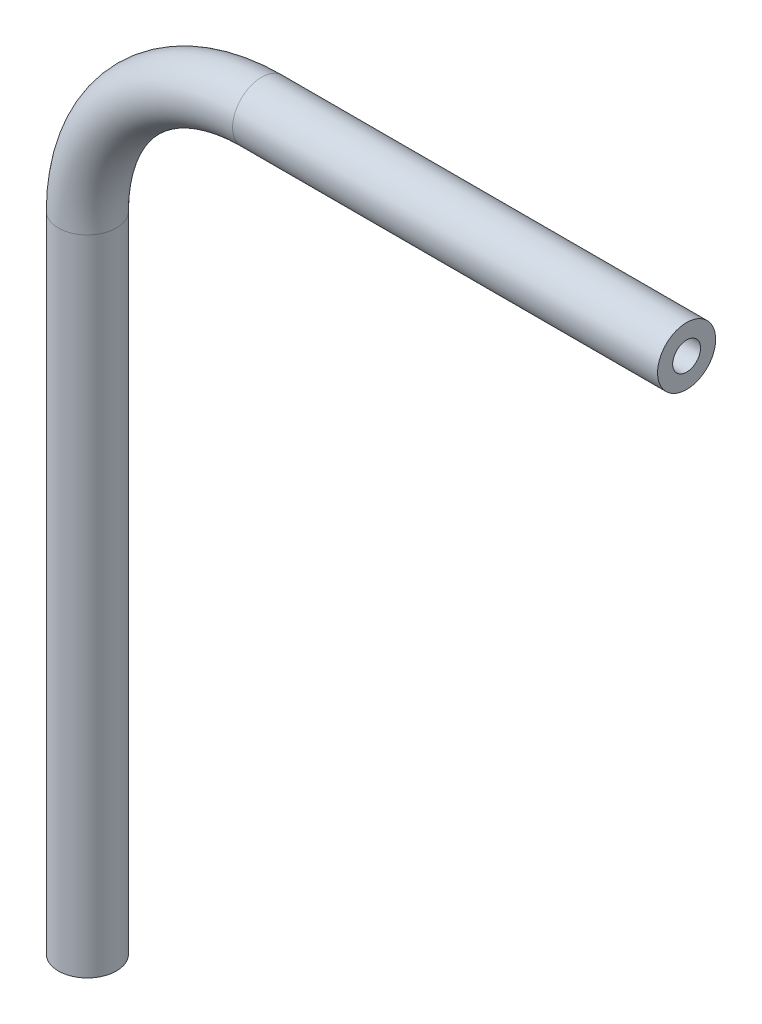
ISO-10303-21;
HEADER;
FILE_DESCRIPTION(('STEP AP214'),'2;1');
FILE_NAME('part.step','',(''),(''),'','','');
FILE_SCHEMA(('AUTOMOTIVE_DESIGN { 1 0 10303 214 1 1 1 1 }'));
ENDSEC;
DATA;
#1=APPLICATION_CONTEXT('core data for automotive mechanical design processes');
#2=APPLICATION_PROTOCOL_DEFINITION('international standard','automotive_design',2000,#1);
#3=PRODUCT_CONTEXT('',#1,'mechanical');
#4=PRODUCT('Part','Part','',(#3));
#5=PRODUCT_RELATED_PRODUCT_CATEGORY('part','',(#4));
#6=PRODUCT_DEFINITION_FORMATION('','',#4);
#7=PRODUCT_DEFINITION_CONTEXT('part definition',#1,'design');
#8=PRODUCT_DEFINITION('design','',#6,#7);
#9=PRODUCT_DEFINITION_SHAPE('','',#8);
#10=(LENGTH_UNIT() NAMED_UNIT(*) SI_UNIT(.MILLI.,.METRE.));
#11=(NAMED_UNIT(*) PLANE_ANGLE_UNIT() SI_UNIT($,.RADIAN.));
#12=(NAMED_UNIT(*) SI_UNIT($,.STERADIAN.) SOLID_ANGLE_UNIT());
#13=UNCERTAINTY_MEASURE_WITH_UNIT(LENGTH_MEASURE(1.E-05),#10,'distance_accuracy_value','');
#14=(GEOMETRIC_REPRESENTATION_CONTEXT(3) GLOBAL_UNCERTAINTY_ASSIGNED_CONTEXT((#13)) GLOBAL_UNIT_ASSIGNED_CONTEXT((#10,
#11,#12)) REPRESENTATION_CONTEXT('',''));
#15=CARTESIAN_POINT('',(0.,0.,0.));
#16=DIRECTION('',(0.,0.,1.));
#17=DIRECTION('',(1.,0.,0.));
#18=AXIS2_PLACEMENT_3D('',#15,#16,#17);
#19=CARTESIAN_POINT('',(0.,-71.8803178807946,0.));
#20=DIRECTION('',(0.,1.,0.));
#21=DIRECTION('',(-1.,0.,0.));
#22=AXIS2_PLACEMENT_3D('',#19,#20,#21);
#23=CYLINDRICAL_SURFACE('',#22,3.175);
#24=CARTESIAN_POINT('',(0.,-1.52231788079483,0.));
#25=DIRECTION('',(0.,1.,0.));
#26=DIRECTION('',(-1.,0.,0.));
#27=AXIS2_PLACEMENT_3D('',#24,#25,#26);
#28=CIRCLE('',#27,3.175);
#29=CARTESIAN_POINT('',(-3.175,-1.52231788079486,0.));
#30=VERTEX_POINT('',#29);
#31=EDGE_CURVE('E84',#30,#30,#28,.T.);
#32=ORIENTED_EDGE('',*,*,#31,.F.);
#33=EDGE_LOOP('',(#32));
#34=FACE_BOUND('',#33,.T.);
#35=CARTESIAN_POINT('',(0.,-71.8803178807946,0.));
#36=DIRECTION('',(0.,1.,0.));
#37=DIRECTION('',(-1.,0.,0.));
#38=AXIS2_PLACEMENT_3D('',#35,#36,#37);
#39=CIRCLE('',#38,3.175);
#40=CARTESIAN_POINT('',(-3.175,-71.8803178807946,0.));
#41=VERTEX_POINT('',#40);
#42=EDGE_CURVE('E53',#41,#41,#39,.T.);
#43=ORIENTED_EDGE('',*,*,#42,.T.);
#44=EDGE_LOOP('',(#43));
#45=FACE_BOUND('',#44,.T.);
#46=ADVANCED_FACE('F38',(#34,#45),#23,.T.);
#47=CARTESIAN_POINT('',(19.05,-1.52231788079469,0.));
#48=DIRECTION('',(0.,0.,-1.));
#49=DIRECTION('',(-1.,0.,0.));
#50=AXIS2_PLACEMENT_3D('',#47,#48,#49);
#51=TOROIDAL_SURFACE('',#50,19.05,3.175);
#52=CARTESIAN_POINT('',(19.0500000000001,17.5276821192053,0.));
#53=DIRECTION('',(1.,0.,0.));
#54=DIRECTION('',(0.,1.,0.));
#55=AXIS2_PLACEMENT_3D('',#52,#53,#54);
#56=CIRCLE('',#55,3.175);
#57=CARTESIAN_POINT('',(19.0500000000001,20.7026821192053,0.));
#58=VERTEX_POINT('',#57);
#59=EDGE_CURVE('E42',#58,#58,#56,.T.);
#60=CARTESIAN_POINT('',(19.05,-1.52231788079469,0.));
#61=DIRECTION('',(0.,0.,-1.));
#62=DIRECTION('',(-1.,0.,0.));
#63=AXIS2_PLACEMENT_3D('',#60,#61,#62);
#64=CIRCLE('',#63,22.225);
#65=EDGE_CURVE('',#30,#58,#64,.T.);
#66=ORIENTED_EDGE('',*,*,#31,.T.);
#67=ORIENTED_EDGE('',*,*,#59,.F.);
#68=ORIENTED_EDGE('',*,*,#65,.T.);
#69=ORIENTED_EDGE('',*,*,#65,.F.);
#70=EDGE_LOOP('',(#66,#68,#67,#69));
#71=FACE_BOUND('',#70,.T.);
#72=ADVANCED_FACE('F92',(#71),#51,.T.);
#73=CARTESIAN_POINT('',(19.0500000000001,17.5276821192053,0.));
#74=DIRECTION('',(1.,0.,0.));
#75=DIRECTION('',(0.,1.,0.));
#76=AXIS2_PLACEMENT_3D('',#73,#74,#75);
#77=CYLINDRICAL_SURFACE('',#76,3.175);
#78=CARTESIAN_POINT('',(65.517903,17.5276821192052,0.));
#79=DIRECTION('',(1.,0.,0.));
#80=DIRECTION('',(0.,1.,0.));
#81=AXIS2_PLACEMENT_3D('',#78,#79,#80);
#82=CIRCLE('',#81,3.175);
#83=CARTESIAN_POINT('',(65.517903,20.7026821192052,0.));
#84=VERTEX_POINT('',#83);
#85=EDGE_CURVE('E58',#84,#84,#82,.T.);
#86=ORIENTED_EDGE('',*,*,#85,.F.);
#87=EDGE_LOOP('',(#86));
#88=FACE_BOUND('',#87,.T.);
#89=ORIENTED_EDGE('',*,*,#59,.T.);
#90=EDGE_LOOP('',(#89));
#91=FACE_BOUND('',#90,.T.);
#92=ADVANCED_FACE('F40',(#88,#91),#77,.T.);
#93=CARTESIAN_POINT('',(0.,-71.8803178807946,0.));
#94=DIRECTION('',(0.,1.,0.));
#95=DIRECTION('',(-1.,0.,0.));
#96=AXIS2_PLACEMENT_3D('',#93,#94,#95);
#97=PLANE('',#96);
#98=CARTESIAN_POINT('',(0.,-71.8803178807946,0.));
#99=DIRECTION('',(0.,1.,0.));
#100=DIRECTION('',(-1.,0.,0.));
#101=AXIS2_PLACEMENT_3D('',#98,#99,#100);
#102=CIRCLE('',#101,1.524);
#103=CARTESIAN_POINT('',(-1.524,-71.8803178807946,0.));
#104=VERTEX_POINT('',#103);
#105=EDGE_CURVE('E79',#104,#104,#102,.F.);
#106=ORIENTED_EDGE('',*,*,#105,.F.);
#107=EDGE_LOOP('',(#106));
#108=FACE_BOUND('',#107,.T.);
#109=ORIENTED_EDGE('',*,*,#42,.F.);
#110=EDGE_LOOP('',(#109));
#111=FACE_BOUND('',#110,.T.);
#112=ADVANCED_FACE('F98',(#108,#111),#97,.F.);
#113=CARTESIAN_POINT('',(65.517903,17.5276821192052,0.));
#114=DIRECTION('',(1.,0.,0.));
#115=DIRECTION('',(0.,1.,0.));
#116=AXIS2_PLACEMENT_3D('',#113,#114,#115);
#117=PLANE('',#116);
#118=CARTESIAN_POINT('',(65.517903,17.5276821192052,0.));
#119=DIRECTION('',(1.,0.,0.));
#120=DIRECTION('',(0.,1.,0.));
#121=AXIS2_PLACEMENT_3D('',#118,#119,#120);
#122=CIRCLE('',#121,1.524);
#123=CARTESIAN_POINT('',(65.517903,19.0516821192052,0.));
#124=VERTEX_POINT('',#123);
#125=EDGE_CURVE('E11',#124,#124,#122,.F.);
#126=ORIENTED_EDGE('',*,*,#125,.T.);
#127=EDGE_LOOP('',(#126));
#128=FACE_BOUND('',#127,.T.);
#129=ORIENTED_EDGE('',*,*,#85,.T.);
#130=EDGE_LOOP('',(#129));
#131=FACE_BOUND('',#130,.T.);
#132=ADVANCED_FACE('F65',(#128,#131),#117,.T.);
#133=CARTESIAN_POINT('',(0.,-71.8803178807946,0.));
#134=DIRECTION('',(0.,1.,0.));
#135=DIRECTION('',(-1.,0.,0.));
#136=AXIS2_PLACEMENT_3D('',#133,#134,#135);
#137=CYLINDRICAL_SURFACE('',#136,1.524);
#138=CARTESIAN_POINT('',(0.,-1.52231788079483,0.));
#139=DIRECTION('',(0.,1.,0.));
#140=DIRECTION('',(-1.,0.,0.));
#141=AXIS2_PLACEMENT_3D('',#138,#139,#140);
#142=CIRCLE('',#141,1.524);
#143=CARTESIAN_POINT('',(-1.524,-1.52231788079485,0.));
#144=VERTEX_POINT('',#143);
#145=EDGE_CURVE('E76',#144,#144,#142,.F.);
#146=ORIENTED_EDGE('',*,*,#145,.F.);
#147=EDGE_LOOP('',(#146));
#148=FACE_BOUND('',#147,.T.);
#149=ORIENTED_EDGE('',*,*,#105,.T.);
#150=EDGE_LOOP('',(#149));
#151=FACE_BOUND('',#150,.T.);
#152=ADVANCED_FACE('F106',(#148,#151),#137,.F.);
#153=CARTESIAN_POINT('',(19.05,-1.52231788079469,0.));
#154=DIRECTION('',(0.,0.,-1.));
#155=DIRECTION('',(-1.,0.,0.));
#156=AXIS2_PLACEMENT_3D('',#153,#154,#155);
#157=TOROIDAL_SURFACE('',#156,19.05,1.524);
#158=CARTESIAN_POINT('',(19.0500000000001,17.5276821192053,0.));
#159=DIRECTION('',(1.,0.,0.));
#160=DIRECTION('',(0.,1.,0.));
#161=AXIS2_PLACEMENT_3D('',#158,#159,#160);
#162=CIRCLE('',#161,1.524);
#163=CARTESIAN_POINT('',(19.0500000000001,19.0516821192053,0.));
#164=VERTEX_POINT('',#163);
#165=EDGE_CURVE('E47',#164,#164,#162,.F.);
#166=CARTESIAN_POINT('',(19.05,-1.52231788079469,0.));
#167=DIRECTION('',(0.,0.,-1.));
#168=DIRECTION('',(-1.,0.,0.));
#169=AXIS2_PLACEMENT_3D('',#166,#167,#168);
#170=CIRCLE('',#169,20.574);
#171=EDGE_CURVE('',#144,#164,#170,.T.);
#172=ORIENTED_EDGE('',*,*,#145,.T.);
#173=ORIENTED_EDGE('',*,*,#165,.F.);
#174=ORIENTED_EDGE('',*,*,#171,.T.);
#175=ORIENTED_EDGE('',*,*,#171,.F.);
#176=EDGE_LOOP('',(#172,#174,#173,#175));
#177=FACE_BOUND('',#176,.T.);
#178=ADVANCED_FACE('F71',(#177),#157,.F.);
#179=CARTESIAN_POINT('',(19.0500000000001,17.5276821192053,0.));
#180=DIRECTION('',(1.,0.,0.));
#181=DIRECTION('',(0.,1.,0.));
#182=AXIS2_PLACEMENT_3D('',#179,#180,#181);
#183=CYLINDRICAL_SURFACE('',#182,1.524);
#184=ORIENTED_EDGE('',*,*,#125,.F.);
#185=EDGE_LOOP('',(#184));
#186=FACE_BOUND('',#185,.T.);
#187=ORIENTED_EDGE('',*,*,#165,.T.);
#188=EDGE_LOOP('',(#187));
#189=FACE_BOUND('',#188,.T.);
#190=ADVANCED_FACE('F68',(#186,#189),#183,.F.);
#191=CLOSED_SHELL('',(#46,#72,#92,#112,#132,#152,#178,#190));
#192=MANIFOLD_SOLID_BREP('B2',#191);
#193=ADVANCED_BREP_SHAPE_REPRESENTATION('',(#18,#192),#14);
#194=SHAPE_DEFINITION_REPRESENTATION(#9,#193);
ENDSEC;
END-ISO-10303-21;
